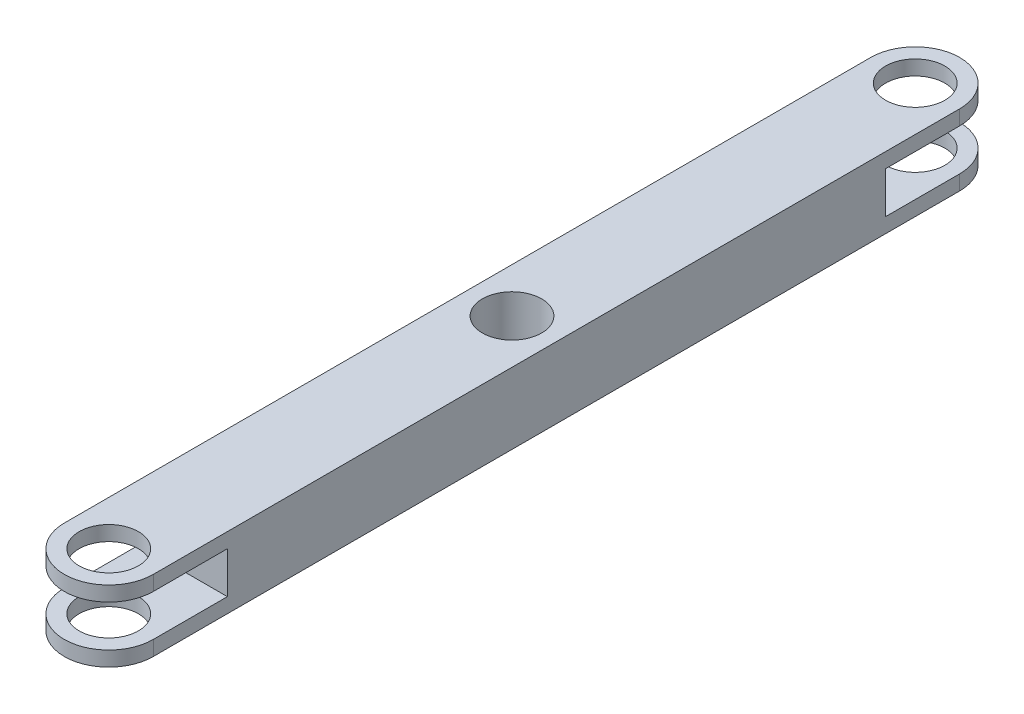
ISO-10303-21;
HEADER;
FILE_DESCRIPTION(('STEP AP214'),'2;1');
FILE_NAME('part.step','',(''),(''),'','','');
FILE_SCHEMA(('AUTOMOTIVE_DESIGN { 1 0 10303 214 1 1 1 1 }'));
ENDSEC;
DATA;
#1=APPLICATION_CONTEXT('core data for automotive mechanical design processes');
#2=APPLICATION_PROTOCOL_DEFINITION('international standard','automotive_design',2000,#1);
#3=PRODUCT_CONTEXT('',#1,'mechanical');
#4=PRODUCT('Part','Part','',(#3));
#5=PRODUCT_RELATED_PRODUCT_CATEGORY('part','',(#4));
#6=PRODUCT_DEFINITION_FORMATION('','',#4);
#7=PRODUCT_DEFINITION_CONTEXT('part definition',#1,'design');
#8=PRODUCT_DEFINITION('design','',#6,#7);
#9=PRODUCT_DEFINITION_SHAPE('','',#8);
#10=(LENGTH_UNIT() NAMED_UNIT(*) SI_UNIT(.MILLI.,.METRE.));
#11=(NAMED_UNIT(*) PLANE_ANGLE_UNIT() SI_UNIT($,.RADIAN.));
#12=(NAMED_UNIT(*) SI_UNIT($,.STERADIAN.) SOLID_ANGLE_UNIT());
#13=UNCERTAINTY_MEASURE_WITH_UNIT(LENGTH_MEASURE(1.E-05),#10,'distance_accuracy_value','');
#14=(GEOMETRIC_REPRESENTATION_CONTEXT(3) GLOBAL_UNCERTAINTY_ASSIGNED_CONTEXT((#13)) GLOBAL_UNIT_ASSIGNED_CONTEXT((#10,
#11,#12)) REPRESENTATION_CONTEXT('',''));
#15=CARTESIAN_POINT('',(0.,0.,0.));
#16=DIRECTION('',(0.,0.,1.));
#17=DIRECTION('',(1.,0.,0.));
#18=AXIS2_PLACEMENT_3D('',#15,#16,#17);
#19=CARTESIAN_POINT('',(0.,6.,-34.));
#20=DIRECTION('',(0.,-1.,0.));
#21=DIRECTION('',(0.,0.,-1.));
#22=AXIS2_PLACEMENT_3D('',#19,#20,#21);
#23=CYLINDRICAL_SURFACE('',#22,3.75);
#24=DIRECTION('',(0.,-1.,0.));
#25=VECTOR('',#24,1.);
#26=CARTESIAN_POINT('',(3.74999999999999,6.,-34.));
#27=LINE('',#26,#25);
#28=CARTESIAN_POINT('',(3.74999999999999,6.,-34.));
#29=VERTEX_POINT('',#28);
#30=CARTESIAN_POINT('',(3.74999999999999,4.75,-34.));
#31=VERTEX_POINT('',#30);
#32=EDGE_CURVE('E223',#29,#31,#27,.T.);
#33=ORIENTED_EDGE('',*,*,#32,.T.);
#34=CARTESIAN_POINT('',(0.,4.75,-34.));
#35=DIRECTION('',(0.,1.,0.));
#36=DIRECTION('',(0.,0.,1.));
#37=AXIS2_PLACEMENT_3D('',#34,#35,#36);
#38=CIRCLE('',#37,3.75);
#39=CARTESIAN_POINT('',(-3.75,4.75,-34.));
#40=VERTEX_POINT('',#39);
#41=EDGE_CURVE('E177',#31,#40,#38,.T.);
#42=ORIENTED_EDGE('',*,*,#41,.T.);
#43=DIRECTION('',(0.,-1.,0.));
#44=VECTOR('',#43,1.);
#45=CARTESIAN_POINT('',(-3.75000000000001,6.,-34.));
#46=LINE('',#45,#44);
#47=CARTESIAN_POINT('',(-3.75000000000001,6.,-34.));
#48=VERTEX_POINT('',#47);
#49=EDGE_CURVE('E234',#48,#40,#46,.T.);
#50=ORIENTED_EDGE('',*,*,#49,.F.);
#51=CARTESIAN_POINT('',(0.,6.,-34.));
#52=DIRECTION('',(0.,1.,0.));
#53=DIRECTION('',(0.,0.,1.));
#54=AXIS2_PLACEMENT_3D('',#51,#52,#53);
#55=CIRCLE('',#54,3.75);
#56=EDGE_CURVE('E203',#29,#48,#55,.T.);
#57=ORIENTED_EDGE('',*,*,#56,.F.);
#58=EDGE_LOOP('',(#33,#42,#50,#57));
#59=FACE_BOUND('',#58,.T.);
#60=ADVANCED_FACE('F38',(#59),#23,.T.);
#61=CARTESIAN_POINT('',(0.,6.,34.));
#62=DIRECTION('',(0.,-1.,0.));
#63=DIRECTION('',(0.,0.,-1.));
#64=AXIS2_PLACEMENT_3D('',#61,#62,#63);
#65=CYLINDRICAL_SURFACE('',#64,3.75);
#66=DIRECTION('',(0.,-1.,0.));
#67=VECTOR('',#66,1.);
#68=CARTESIAN_POINT('',(-3.75,6.,34.));
#69=LINE('',#68,#67);
#70=CARTESIAN_POINT('',(-3.75,6.,34.));
#71=VERTEX_POINT('',#70);
#72=CARTESIAN_POINT('',(-3.75,4.75,34.));
#73=VERTEX_POINT('',#72);
#74=EDGE_CURVE('E230',#71,#73,#69,.T.);
#75=ORIENTED_EDGE('',*,*,#74,.T.);
#76=CARTESIAN_POINT('',(0.,4.75,34.));
#77=DIRECTION('',(0.,1.,0.));
#78=DIRECTION('',(0.,0.,1.));
#79=AXIS2_PLACEMENT_3D('',#76,#77,#78);
#80=CIRCLE('',#79,3.75);
#81=CARTESIAN_POINT('',(3.75,4.75,34.));
#82=VERTEX_POINT('',#81);
#83=EDGE_CURVE('E158',#73,#82,#80,.T.);
#84=ORIENTED_EDGE('',*,*,#83,.T.);
#85=DIRECTION('',(0.,-1.,0.));
#86=VECTOR('',#85,1.);
#87=CARTESIAN_POINT('',(3.75,6.,34.));
#88=LINE('',#87,#86);
#89=CARTESIAN_POINT('',(3.75,6.,34.));
#90=VERTEX_POINT('',#89);
#91=EDGE_CURVE('E227',#90,#82,#88,.T.);
#92=ORIENTED_EDGE('',*,*,#91,.F.);
#93=CARTESIAN_POINT('',(0.,6.,34.));
#94=DIRECTION('',(0.,1.,0.));
#95=DIRECTION('',(0.,0.,1.));
#96=AXIS2_PLACEMENT_3D('',#93,#94,#95);
#97=CIRCLE('',#96,3.75);
#98=EDGE_CURVE('E209',#71,#90,#97,.T.);
#99=ORIENTED_EDGE('',*,*,#98,.F.);
#100=EDGE_LOOP('',(#75,#84,#92,#99));
#101=FACE_BOUND('',#100,.T.);
#102=ADVANCED_FACE('F281',(#101),#65,.T.);
#103=CARTESIAN_POINT('',(0.,6.,-34.));
#104=DIRECTION('',(0.,-1.,0.));
#105=DIRECTION('',(0.,0.,-1.));
#106=AXIS2_PLACEMENT_3D('',#103,#104,#105);
#107=CYLINDRICAL_SURFACE('',#106,2.5);
#108=CARTESIAN_POINT('',(0.,4.75,-34.));
#109=DIRECTION('',(0.,1.,0.));
#110=DIRECTION('',(0.,0.,1.));
#111=AXIS2_PLACEMENT_3D('',#108,#109,#110);
#112=CIRCLE('',#111,2.5);
#113=CARTESIAN_POINT('',(0.,4.75,-31.5));
#114=VERTEX_POINT('',#113);
#115=EDGE_CURVE('E173',#114,#114,#112,.T.);
#116=ORIENTED_EDGE('',*,*,#115,.F.);
#117=EDGE_LOOP('',(#116));
#118=FACE_BOUND('',#117,.T.);
#119=CARTESIAN_POINT('',(0.,6.,-34.));
#120=DIRECTION('',(0.,1.,0.));
#121=DIRECTION('',(0.,0.,1.));
#122=AXIS2_PLACEMENT_3D('',#119,#120,#121);
#123=CIRCLE('',#122,2.5);
#124=CARTESIAN_POINT('',(0.,6.,-31.5));
#125=VERTEX_POINT('',#124);
#126=EDGE_CURVE('E197',#125,#125,#123,.T.);
#127=ORIENTED_EDGE('',*,*,#126,.T.);
#128=EDGE_LOOP('',(#127));
#129=FACE_BOUND('',#128,.T.);
#130=ADVANCED_FACE('F302',(#118,#129),#107,.F.);
#131=CARTESIAN_POINT('',(0.,6.,34.));
#132=DIRECTION('',(0.,-1.,0.));
#133=DIRECTION('',(0.,0.,-1.));
#134=AXIS2_PLACEMENT_3D('',#131,#132,#133);
#135=CYLINDRICAL_SURFACE('',#134,2.5);
#136=CARTESIAN_POINT('',(0.,4.75,34.));
#137=DIRECTION('',(0.,1.,0.));
#138=DIRECTION('',(0.,0.,1.));
#139=AXIS2_PLACEMENT_3D('',#136,#137,#138);
#140=CIRCLE('',#139,2.5);
#141=CARTESIAN_POINT('',(0.,4.75,36.5));
#142=VERTEX_POINT('',#141);
#143=EDGE_CURVE('E148',#142,#142,#140,.T.);
#144=ORIENTED_EDGE('',*,*,#143,.F.);
#145=EDGE_LOOP('',(#144));
#146=FACE_BOUND('',#145,.T.);
#147=CARTESIAN_POINT('',(0.,6.,34.));
#148=DIRECTION('',(0.,1.,0.));
#149=DIRECTION('',(0.,0.,1.));
#150=AXIS2_PLACEMENT_3D('',#147,#148,#149);
#151=CIRCLE('',#150,2.5);
#152=CARTESIAN_POINT('',(0.,6.,36.5));
#153=VERTEX_POINT('',#152);
#154=EDGE_CURVE('E191',#153,#153,#151,.T.);
#155=ORIENTED_EDGE('',*,*,#154,.T.);
#156=EDGE_LOOP('',(#155));
#157=FACE_BOUND('',#156,.T.);
#158=ADVANCED_FACE('F314',(#146,#157),#135,.F.);
#159=CARTESIAN_POINT('',(0.,6.,-34.));
#160=DIRECTION('',(0.,1.,0.));
#161=DIRECTION('',(0.,0.,1.));
#162=AXIS2_PLACEMENT_3D('',#159,#160,#161);
#163=PLANE('',#162);
#164=ORIENTED_EDGE('',*,*,#154,.F.);
#165=EDGE_LOOP('',(#164));
#166=FACE_BOUND('',#165,.T.);
#167=ORIENTED_EDGE('',*,*,#56,.T.);
#168=DIRECTION('',(0.,0.,1.));
#169=VECTOR('',#168,1.);
#170=CARTESIAN_POINT('',(-3.75000000000001,6.,-34.));
#171=LINE('',#170,#169);
#172=EDGE_CURVE('E206',#48,#71,#171,.T.);
#173=ORIENTED_EDGE('',*,*,#172,.T.);
#174=ORIENTED_EDGE('',*,*,#98,.T.);
#175=DIRECTION('',(0.,0.,-1.));
#176=VECTOR('',#175,1.);
#177=CARTESIAN_POINT('',(3.75,6.,34.));
#178=LINE('',#177,#176);
#179=EDGE_CURVE('E211',#90,#29,#178,.T.);
#180=ORIENTED_EDGE('',*,*,#179,.T.);
#181=EDGE_LOOP('',(#167,#173,#174,#180));
#182=FACE_BOUND('',#181,.T.);
#183=ORIENTED_EDGE('',*,*,#126,.F.);
#184=EDGE_LOOP('',(#183));
#185=FACE_BOUND('',#184,.T.);
#186=CARTESIAN_POINT('',(0.,6.,0.));
#187=DIRECTION('',(0.,1.,0.));
#188=DIRECTION('',(0.,0.,1.));
#189=AXIS2_PLACEMENT_3D('',#186,#187,#188);
#190=CIRCLE('',#189,2.5);
#191=CARTESIAN_POINT('',(0.,6.,2.5));
#192=VERTEX_POINT('',#191);
#193=EDGE_CURVE('E185',#192,#192,#190,.T.);
#194=ORIENTED_EDGE('',*,*,#193,.F.);
#195=EDGE_LOOP('',(#194));
#196=FACE_BOUND('',#195,.T.);
#197=ADVANCED_FACE('F276',(#166,#182,#185,#196),#163,.T.);
#198=CARTESIAN_POINT('',(0.,0.,-34.));
#199=DIRECTION('',(0.,1.,0.));
#200=DIRECTION('',(0.,0.,1.));
#201=AXIS2_PLACEMENT_3D('',#198,#199,#200);
#202=PLANE('',#201);
#203=CARTESIAN_POINT('',(0.,0.,-34.));
#204=DIRECTION('',(0.,1.,0.));
#205=DIRECTION('',(0.,0.,1.));
#206=AXIS2_PLACEMENT_3D('',#203,#204,#205);
#207=CIRCLE('',#206,3.75);
#208=CARTESIAN_POINT('',(3.74999999999999,0.,-34.));
#209=VERTEX_POINT('',#208);
#210=CARTESIAN_POINT('',(-3.75000000000001,0.,-34.));
#211=VERTEX_POINT('',#210);
#212=EDGE_CURVE('E200',#209,#211,#207,.T.);
#213=ORIENTED_EDGE('',*,*,#212,.F.);
#214=DIRECTION('',(0.,0.,-1.));
#215=VECTOR('',#214,1.);
#216=CARTESIAN_POINT('',(3.75,0.,34.));
#217=LINE('',#216,#215);
#218=CARTESIAN_POINT('',(3.75,0.,34.));
#219=VERTEX_POINT('',#218);
#220=EDGE_CURVE('E207',#219,#209,#217,.T.);
#221=ORIENTED_EDGE('',*,*,#220,.F.);
#222=CARTESIAN_POINT('',(0.,0.,34.));
#223=DIRECTION('',(0.,1.,0.));
#224=DIRECTION('',(0.,0.,1.));
#225=AXIS2_PLACEMENT_3D('',#222,#223,#224);
#226=CIRCLE('',#225,3.75);
#227=CARTESIAN_POINT('',(-3.75,0.,34.));
#228=VERTEX_POINT('',#227);
#229=EDGE_CURVE('E218',#228,#219,#226,.T.);
#230=ORIENTED_EDGE('',*,*,#229,.F.);
#231=DIRECTION('',(0.,0.,1.));
#232=VECTOR('',#231,1.);
#233=CARTESIAN_POINT('',(-3.75000000000001,0.,-34.));
#234=LINE('',#233,#232);
#235=EDGE_CURVE('E216',#211,#228,#234,.T.);
#236=ORIENTED_EDGE('',*,*,#235,.F.);
#237=EDGE_LOOP('',(#213,#221,#230,#236));
#238=FACE_BOUND('',#237,.T.);
#239=CARTESIAN_POINT('',(0.,0.,-34.));
#240=DIRECTION('',(0.,1.,0.));
#241=DIRECTION('',(0.,0.,1.));
#242=AXIS2_PLACEMENT_3D('',#239,#240,#241);
#243=CIRCLE('',#242,2.5);
#244=CARTESIAN_POINT('',(0.,0.,-31.5));
#245=VERTEX_POINT('',#244);
#246=EDGE_CURVE('E194',#245,#245,#243,.T.);
#247=ORIENTED_EDGE('',*,*,#246,.T.);
#248=EDGE_LOOP('',(#247));
#249=FACE_BOUND('',#248,.T.);
#250=CARTESIAN_POINT('',(0.,0.,34.));
#251=DIRECTION('',(0.,1.,0.));
#252=DIRECTION('',(0.,0.,1.));
#253=AXIS2_PLACEMENT_3D('',#250,#251,#252);
#254=CIRCLE('',#253,2.5);
#255=CARTESIAN_POINT('',(0.,0.,36.5));
#256=VERTEX_POINT('',#255);
#257=EDGE_CURVE('E188',#256,#256,#254,.T.);
#258=ORIENTED_EDGE('',*,*,#257,.T.);
#259=EDGE_LOOP('',(#258));
#260=FACE_BOUND('',#259,.T.);
#261=CARTESIAN_POINT('',(0.,0.,0.));
#262=DIRECTION('',(0.,1.,0.));
#263=DIRECTION('',(0.,0.,1.));
#264=AXIS2_PLACEMENT_3D('',#261,#262,#263);
#265=CIRCLE('',#264,2.5);
#266=CARTESIAN_POINT('',(0.,0.,2.5));
#267=VERTEX_POINT('',#266);
#268=EDGE_CURVE('E137',#267,#267,#265,.T.);
#269=ORIENTED_EDGE('',*,*,#268,.T.);
#270=EDGE_LOOP('',(#269));
#271=FACE_BOUND('',#270,.T.);
#272=ADVANCED_FACE('F264',(#238,#249,#260,#271),#202,.F.);
#273=CARTESIAN_POINT('',(-3.75,1.25,-34.));
#274=VERTEX_POINT('',#273);
#275=EDGE_CURVE('E233',#274,#211,#46,.T.);
#276=ORIENTED_EDGE('',*,*,#275,.F.);
#277=CARTESIAN_POINT('',(0.,1.25,-34.));
#278=DIRECTION('',(0.,-1.,0.));
#279=DIRECTION('',(0.,0.,-1.));
#280=AXIS2_PLACEMENT_3D('',#277,#278,#279);
#281=CIRCLE('',#280,3.75);
#282=CARTESIAN_POINT('',(3.74999999999999,1.25,-34.));
#283=VERTEX_POINT('',#282);
#284=EDGE_CURVE('E167',#274,#283,#281,.T.);
#285=ORIENTED_EDGE('',*,*,#284,.T.);
#286=EDGE_CURVE('E213',#283,#209,#27,.T.);
#287=ORIENTED_EDGE('',*,*,#286,.T.);
#288=ORIENTED_EDGE('',*,*,#212,.T.);
#289=EDGE_LOOP('',(#276,#285,#287,#288));
#290=FACE_BOUND('',#289,.T.);
#291=ADVANCED_FACE('F40',(#290),#23,.T.);
#292=CARTESIAN_POINT('',(-3.75000000000001,6.,-34.));
#293=DIRECTION('',(1.,0.,0.));
#294=DIRECTION('',(0.,0.,-1.));
#295=AXIS2_PLACEMENT_3D('',#292,#293,#294);
#296=PLANE('',#295);
#297=DIRECTION('',(0.,1.,0.));
#298=VECTOR('',#297,1.);
#299=CARTESIAN_POINT('',(-3.75,6.,27.75));
#300=LINE('',#299,#298);
#301=CARTESIAN_POINT('',(-3.75,1.25,27.75));
#302=VERTEX_POINT('',#301);
#303=CARTESIAN_POINT('',(-3.75,4.75,27.75));
#304=VERTEX_POINT('',#303);
#305=EDGE_CURVE('E128',#302,#304,#300,.T.);
#306=ORIENTED_EDGE('',*,*,#305,.T.);
#307=DIRECTION('',(0.,0.,1.));
#308=VECTOR('',#307,1.);
#309=CARTESIAN_POINT('',(-3.75000000000001,4.75000000000001,-34.));
#310=LINE('',#309,#308);
#311=EDGE_CURVE('E161',#304,#73,#310,.T.);
#312=ORIENTED_EDGE('',*,*,#311,.T.);
#313=ORIENTED_EDGE('',*,*,#74,.F.);
#314=ORIENTED_EDGE('',*,*,#172,.F.);
#315=ORIENTED_EDGE('',*,*,#49,.T.);
#316=DIRECTION('',(0.,0.,1.));
#317=VECTOR('',#316,1.);
#318=CARTESIAN_POINT('',(-3.75000000000001,4.75,-34.));
#319=LINE('',#318,#317);
#320=CARTESIAN_POINT('',(-3.75000000000001,4.75,-27.75));
#321=VERTEX_POINT('',#320);
#322=EDGE_CURVE('E180',#40,#321,#319,.T.);
#323=ORIENTED_EDGE('',*,*,#322,.T.);
#324=DIRECTION('',(0.,-1.,0.));
#325=VECTOR('',#324,1.);
#326=CARTESIAN_POINT('',(-3.75000000000001,6.,-27.75));
#327=LINE('',#326,#325);
#328=CARTESIAN_POINT('',(-3.75000000000001,1.25,-27.75));
#329=VERTEX_POINT('',#328);
#330=EDGE_CURVE('E138',#321,#329,#327,.T.);
#331=ORIENTED_EDGE('',*,*,#330,.T.);
#332=DIRECTION('',(0.,0.,-1.));
#333=VECTOR('',#332,1.);
#334=CARTESIAN_POINT('',(-3.75000000000001,1.25,-34.));
#335=LINE('',#334,#333);
#336=EDGE_CURVE('E170',#329,#274,#335,.T.);
#337=ORIENTED_EDGE('',*,*,#336,.T.);
#338=ORIENTED_EDGE('',*,*,#275,.T.);
#339=ORIENTED_EDGE('',*,*,#235,.T.);
#340=CARTESIAN_POINT('',(-3.75,1.25,34.));
#341=VERTEX_POINT('',#340);
#342=EDGE_CURVE('E147',#341,#228,#69,.T.);
#343=ORIENTED_EDGE('',*,*,#342,.F.);
#344=DIRECTION('',(0.,0.,-1.));
#345=VECTOR('',#344,1.);
#346=CARTESIAN_POINT('',(-3.75000000000001,1.25,-34.));
#347=LINE('',#346,#345);
#348=EDGE_CURVE('E141',#341,#302,#347,.T.);
#349=ORIENTED_EDGE('',*,*,#348,.T.);
#350=EDGE_LOOP('',(#306,#312,#313,#314,#315,#323,#331,#337,#338,#339,#343,#349));
#351=FACE_BOUND('',#350,.T.);
#352=ADVANCED_FACE('F145',(#351),#296,.F.);
#353=CARTESIAN_POINT('',(3.75,1.25,34.));
#354=VERTEX_POINT('',#353);
#355=EDGE_CURVE('E226',#354,#219,#88,.T.);
#356=ORIENTED_EDGE('',*,*,#355,.F.);
#357=CARTESIAN_POINT('',(0.,1.25,34.));
#358=DIRECTION('',(0.,-1.,0.));
#359=DIRECTION('',(0.,0.,-1.));
#360=AXIS2_PLACEMENT_3D('',#357,#358,#359);
#361=CIRCLE('',#360,3.75);
#362=EDGE_CURVE('E61',#354,#341,#361,.T.);
#363=ORIENTED_EDGE('',*,*,#362,.T.);
#364=ORIENTED_EDGE('',*,*,#342,.T.);
#365=ORIENTED_EDGE('',*,*,#229,.T.);
#366=EDGE_LOOP('',(#356,#363,#364,#365));
#367=FACE_BOUND('',#366,.T.);
#368=ADVANCED_FACE('F258',(#367),#65,.T.);
#369=CARTESIAN_POINT('',(3.75,6.,34.));
#370=DIRECTION('',(-1.,0.,0.));
#371=DIRECTION('',(0.,0.,1.));
#372=AXIS2_PLACEMENT_3D('',#369,#370,#371);
#373=PLANE('',#372);
#374=ORIENTED_EDGE('',*,*,#91,.T.);
#375=DIRECTION('',(0.,0.,-1.));
#376=VECTOR('',#375,1.);
#377=CARTESIAN_POINT('',(3.75,4.75,34.));
#378=LINE('',#377,#376);
#379=CARTESIAN_POINT('',(3.75,4.75,27.75));
#380=VERTEX_POINT('',#379);
#381=EDGE_CURVE('E151',#82,#380,#378,.T.);
#382=ORIENTED_EDGE('',*,*,#381,.T.);
#383=DIRECTION('',(0.,-1.,0.));
#384=VECTOR('',#383,1.);
#385=CARTESIAN_POINT('',(3.75,6.,27.75));
#386=LINE('',#385,#384);
#387=CARTESIAN_POINT('',(3.75,1.25,27.75));
#388=VERTEX_POINT('',#387);
#389=EDGE_CURVE('E11',#380,#388,#386,.T.);
#390=ORIENTED_EDGE('',*,*,#389,.T.);
#391=DIRECTION('',(0.,0.,1.));
#392=VECTOR('',#391,1.);
#393=CARTESIAN_POINT('',(3.75,1.25,34.));
#394=LINE('',#393,#392);
#395=EDGE_CURVE('E142',#388,#354,#394,.T.);
#396=ORIENTED_EDGE('',*,*,#395,.T.);
#397=ORIENTED_EDGE('',*,*,#355,.T.);
#398=ORIENTED_EDGE('',*,*,#220,.T.);
#399=ORIENTED_EDGE('',*,*,#286,.F.);
#400=DIRECTION('',(0.,0.,1.));
#401=VECTOR('',#400,1.);
#402=CARTESIAN_POINT('',(3.75,1.25,34.));
#403=LINE('',#402,#401);
#404=CARTESIAN_POINT('',(3.74999999999999,1.25,-27.75));
#405=VERTEX_POINT('',#404);
#406=EDGE_CURVE('E164',#283,#405,#403,.T.);
#407=ORIENTED_EDGE('',*,*,#406,.T.);
#408=DIRECTION('',(0.,1.,0.));
#409=VECTOR('',#408,1.);
#410=CARTESIAN_POINT('',(3.74999999999999,6.,-27.75));
#411=LINE('',#410,#409);
#412=CARTESIAN_POINT('',(3.74999999999999,4.75,-27.75));
#413=VERTEX_POINT('',#412);
#414=EDGE_CURVE('E46',#405,#413,#411,.T.);
#415=ORIENTED_EDGE('',*,*,#414,.T.);
#416=DIRECTION('',(0.,0.,-1.));
#417=VECTOR('',#416,1.);
#418=CARTESIAN_POINT('',(3.75,4.75000000000001,34.));
#419=LINE('',#418,#417);
#420=EDGE_CURVE('E174',#413,#31,#419,.T.);
#421=ORIENTED_EDGE('',*,*,#420,.T.);
#422=ORIENTED_EDGE('',*,*,#32,.F.);
#423=ORIENTED_EDGE('',*,*,#179,.F.);
#424=EDGE_LOOP('',(#374,#382,#390,#396,#397,#398,#399,#407,#415,#421,#422,#423));
#425=FACE_BOUND('',#424,.T.);
#426=ADVANCED_FACE('F245',(#425),#373,.F.);
#427=CARTESIAN_POINT('',(0.,1.25,-34.));
#428=DIRECTION('',(0.,-1.,0.));
#429=DIRECTION('',(0.,0.,-1.));
#430=AXIS2_PLACEMENT_3D('',#427,#428,#429);
#431=CIRCLE('',#430,2.5);
#432=CARTESIAN_POINT('',(0.,1.25,-36.5));
#433=VERTEX_POINT('',#432);
#434=EDGE_CURVE('E163',#433,#433,#431,.T.);
#435=ORIENTED_EDGE('',*,*,#434,.F.);
#436=EDGE_LOOP('',(#435));
#437=FACE_BOUND('',#436,.T.);
#438=ORIENTED_EDGE('',*,*,#246,.F.);
#439=EDGE_LOOP('',(#438));
#440=FACE_BOUND('',#439,.T.);
#441=ADVANCED_FACE('F320',(#437,#440),#107,.F.);
#442=CARTESIAN_POINT('',(0.,1.25,34.));
#443=DIRECTION('',(0.,-1.,0.));
#444=DIRECTION('',(0.,0.,-1.));
#445=AXIS2_PLACEMENT_3D('',#442,#443,#444);
#446=CIRCLE('',#445,2.5);
#447=CARTESIAN_POINT('',(0.,1.25,31.5));
#448=VERTEX_POINT('',#447);
#449=EDGE_CURVE('E237',#448,#448,#446,.T.);
#450=ORIENTED_EDGE('',*,*,#449,.F.);
#451=EDGE_LOOP('',(#450));
#452=FACE_BOUND('',#451,.T.);
#453=ORIENTED_EDGE('',*,*,#257,.F.);
#454=EDGE_LOOP('',(#453));
#455=FACE_BOUND('',#454,.T.);
#456=ADVANCED_FACE('F338',(#452,#455),#135,.F.);
#457=CARTESIAN_POINT('',(0.,6.,0.));
#458=DIRECTION('',(0.,-1.,0.));
#459=DIRECTION('',(0.,0.,-1.));
#460=AXIS2_PLACEMENT_3D('',#457,#458,#459);
#461=CYLINDRICAL_SURFACE('',#460,2.5);
#462=ORIENTED_EDGE('',*,*,#193,.T.);
#463=EDGE_LOOP('',(#462));
#464=FACE_BOUND('',#463,.T.);
#465=ORIENTED_EDGE('',*,*,#268,.F.);
#466=EDGE_LOOP('',(#465));
#467=FACE_BOUND('',#466,.T.);
#468=ADVANCED_FACE('F294',(#464,#467),#461,.F.);
#469=CARTESIAN_POINT('',(-7.5,1.25,27.75));
#470=DIRECTION('',(0.,0.,-1.));
#471=DIRECTION('',(-1.,0.,0.));
#472=AXIS2_PLACEMENT_3D('',#469,#470,#471);
#473=PLANE('',#472);
#474=DIRECTION('',(1.,0.,0.));
#475=VECTOR('',#474,1.);
#476=CARTESIAN_POINT('',(-7.5,1.25,27.75));
#477=LINE('',#476,#475);
#478=EDGE_CURVE('E131',#302,#388,#477,.T.);
#479=ORIENTED_EDGE('',*,*,#478,.T.);
#480=ORIENTED_EDGE('',*,*,#389,.F.);
#481=DIRECTION('',(1.,0.,0.));
#482=VECTOR('',#481,1.);
#483=CARTESIAN_POINT('',(-7.5,4.75,27.75));
#484=LINE('',#483,#482);
#485=EDGE_CURVE('E133',#304,#380,#484,.T.);
#486=ORIENTED_EDGE('',*,*,#485,.F.);
#487=ORIENTED_EDGE('',*,*,#305,.F.);
#488=EDGE_LOOP('',(#479,#480,#486,#487));
#489=FACE_BOUND('',#488,.T.);
#490=ADVANCED_FACE('F130',(#489),#473,.F.);
#491=CARTESIAN_POINT('',(-7.5,4.75,27.75));
#492=DIRECTION('',(0.,1.,0.));
#493=DIRECTION('',(0.,0.,1.));
#494=AXIS2_PLACEMENT_3D('',#491,#492,#493);
#495=PLANE('',#494);
#496=ORIENTED_EDGE('',*,*,#143,.T.);
#497=EDGE_LOOP('',(#496));
#498=FACE_BOUND('',#497,.T.);
#499=ORIENTED_EDGE('',*,*,#485,.T.);
#500=ORIENTED_EDGE('',*,*,#381,.F.);
#501=ORIENTED_EDGE('',*,*,#83,.F.);
#502=ORIENTED_EDGE('',*,*,#311,.F.);
#503=EDGE_LOOP('',(#499,#500,#501,#502));
#504=FACE_BOUND('',#503,.T.);
#505=ADVANCED_FACE('F283',(#498,#504),#495,.F.);
#506=CARTESIAN_POINT('',(-7.5,1.25,40.));
#507=DIRECTION('',(0.,-1.,0.));
#508=DIRECTION('',(0.,0.,-1.));
#509=AXIS2_PLACEMENT_3D('',#506,#507,#508);
#510=PLANE('',#509);
#511=ORIENTED_EDGE('',*,*,#449,.T.);
#512=EDGE_LOOP('',(#511));
#513=FACE_BOUND('',#512,.T.);
#514=ORIENTED_EDGE('',*,*,#362,.F.);
#515=ORIENTED_EDGE('',*,*,#395,.F.);
#516=ORIENTED_EDGE('',*,*,#478,.F.);
#517=ORIENTED_EDGE('',*,*,#348,.F.);
#518=EDGE_LOOP('',(#514,#515,#516,#517));
#519=FACE_BOUND('',#518,.T.);
#520=ADVANCED_FACE('F140',(#513,#519),#510,.F.);
#521=CARTESIAN_POINT('',(-7.5,1.25,-27.75));
#522=DIRECTION('',(0.,0.,1.));
#523=DIRECTION('',(1.,0.,0.));
#524=AXIS2_PLACEMENT_3D('',#521,#522,#523);
#525=PLANE('',#524);
#526=DIRECTION('',(1.,0.,0.));
#527=VECTOR('',#526,1.);
#528=CARTESIAN_POINT('',(-7.5,4.75,-27.75));
#529=LINE('',#528,#527);
#530=EDGE_CURVE('E53',#321,#413,#529,.T.);
#531=ORIENTED_EDGE('',*,*,#530,.T.);
#532=ORIENTED_EDGE('',*,*,#414,.F.);
#533=DIRECTION('',(1.,0.,0.));
#534=VECTOR('',#533,1.);
#535=CARTESIAN_POINT('',(-7.5,1.25,-27.75));
#536=LINE('',#535,#534);
#537=EDGE_CURVE('E251',#329,#405,#536,.T.);
#538=ORIENTED_EDGE('',*,*,#537,.F.);
#539=ORIENTED_EDGE('',*,*,#330,.F.);
#540=EDGE_LOOP('',(#531,#532,#538,#539));
#541=FACE_BOUND('',#540,.T.);
#542=ADVANCED_FACE('F250',(#541),#525,.F.);
#543=CARTESIAN_POINT('',(-7.5,4.75,-27.75));
#544=DIRECTION('',(0.,1.,0.));
#545=DIRECTION('',(0.,0.,1.));
#546=AXIS2_PLACEMENT_3D('',#543,#544,#545);
#547=PLANE('',#546);
#548=ORIENTED_EDGE('',*,*,#115,.T.);
#549=EDGE_LOOP('',(#548));
#550=FACE_BOUND('',#549,.T.);
#551=ORIENTED_EDGE('',*,*,#41,.F.);
#552=ORIENTED_EDGE('',*,*,#420,.F.);
#553=ORIENTED_EDGE('',*,*,#530,.F.);
#554=ORIENTED_EDGE('',*,*,#322,.F.);
#555=EDGE_LOOP('',(#551,#552,#553,#554));
#556=FACE_BOUND('',#555,.T.);
#557=ADVANCED_FACE('F269',(#550,#556),#547,.F.);
#558=CARTESIAN_POINT('',(-7.5,1.25,-40.));
#559=DIRECTION('',(0.,-1.,0.));
#560=DIRECTION('',(0.,0.,-1.));
#561=AXIS2_PLACEMENT_3D('',#558,#559,#560);
#562=PLANE('',#561);
#563=ORIENTED_EDGE('',*,*,#434,.T.);
#564=EDGE_LOOP('',(#563));
#565=FACE_BOUND('',#564,.T.);
#566=ORIENTED_EDGE('',*,*,#537,.T.);
#567=ORIENTED_EDGE('',*,*,#406,.F.);
#568=ORIENTED_EDGE('',*,*,#284,.F.);
#569=ORIENTED_EDGE('',*,*,#336,.F.);
#570=EDGE_LOOP('',(#566,#567,#568,#569));
#571=FACE_BOUND('',#570,.T.);
#572=ADVANCED_FACE('F253',(#565,#571),#562,.F.);
#573=CLOSED_SHELL('',(#60,#102,#130,#158,#197,#272,#291,#352,#368,#426,#441,#456,#468,#490,#505,
#520,#542,#557,#572));
#574=MANIFOLD_SOLID_BREP('B2',#573);
#575=ADVANCED_BREP_SHAPE_REPRESENTATION('',(#18,#574),#14);
#576=SHAPE_DEFINITION_REPRESENTATION(#9,#575);
ENDSEC;
END-ISO-10303-21;
